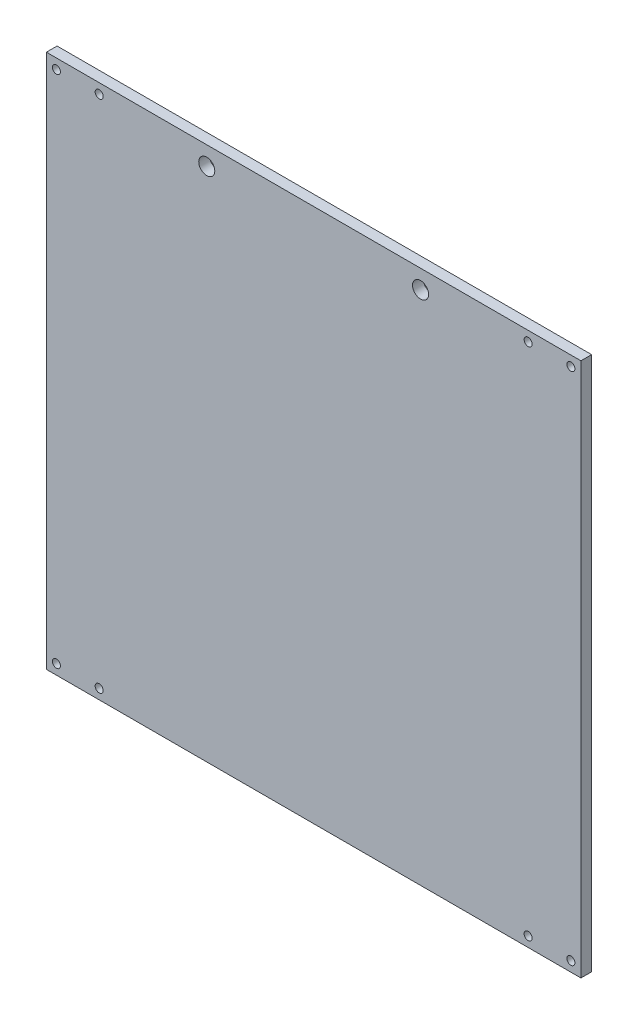
ISO-10303-21;
HEADER;
FILE_DESCRIPTION(('STEP AP214'),'2;1');
FILE_NAME('part.step','',(''),(''),'','','');
FILE_SCHEMA(('AUTOMOTIVE_DESIGN { 1 0 10303 214 1 1 1 1 }'));
ENDSEC;
DATA;
#1=APPLICATION_CONTEXT('core data for automotive mechanical design processes');
#2=APPLICATION_PROTOCOL_DEFINITION('international standard','automotive_design',2000,#1);
#3=PRODUCT_CONTEXT('',#1,'mechanical');
#4=PRODUCT('Part','Part','',(#3));
#5=PRODUCT_RELATED_PRODUCT_CATEGORY('part','',(#4));
#6=PRODUCT_DEFINITION_FORMATION('','',#4);
#7=PRODUCT_DEFINITION_CONTEXT('part definition',#1,'design');
#8=PRODUCT_DEFINITION('design','',#6,#7);
#9=PRODUCT_DEFINITION_SHAPE('','',#8);
#10=(LENGTH_UNIT() NAMED_UNIT(*) SI_UNIT(.MILLI.,.METRE.));
#11=(NAMED_UNIT(*) PLANE_ANGLE_UNIT() SI_UNIT($,.RADIAN.));
#12=(NAMED_UNIT(*) SI_UNIT($,.STERADIAN.) SOLID_ANGLE_UNIT());
#13=UNCERTAINTY_MEASURE_WITH_UNIT(LENGTH_MEASURE(1.E-05),#10,'distance_accuracy_value','');
#14=(GEOMETRIC_REPRESENTATION_CONTEXT(3) GLOBAL_UNCERTAINTY_ASSIGNED_CONTEXT((#13)) GLOBAL_UNIT_ASSIGNED_CONTEXT((#10,
#11,#12)) REPRESENTATION_CONTEXT('',''));
#15=CARTESIAN_POINT('',(0.,0.,0.));
#16=DIRECTION('',(0.,0.,1.));
#17=DIRECTION('',(1.,0.,0.));
#18=AXIS2_PLACEMENT_3D('',#15,#16,#17);
#19=CARTESIAN_POINT('',(0.,0.,4.));
#20=DIRECTION('',(0.,0.,-1.));
#21=DIRECTION('',(-1.,0.,0.));
#22=AXIS2_PLACEMENT_3D('',#19,#20,#21);
#23=PLANE('',#22);
#24=CARTESIAN_POINT('',(40.,93.,4.));
#25=DIRECTION('',(0.,0.,-1.));
#26=DIRECTION('',(-1.,0.,0.));
#27=AXIS2_PLACEMENT_3D('',#24,#25,#26);
#28=CIRCLE('',#27,3.);
#29=CARTESIAN_POINT('',(37.,93.,4.));
#30=VERTEX_POINT('',#29);
#31=EDGE_CURVE('E158',#30,#30,#28,.F.);
#32=ORIENTED_EDGE('',*,*,#31,.F.);
#33=EDGE_LOOP('',(#32));
#34=FACE_BOUND('',#33,.T.);
#35=CARTESIAN_POINT('',(-40.,93.,4.));
#36=DIRECTION('',(0.,0.,-1.));
#37=DIRECTION('',(-1.,0.,0.));
#38=AXIS2_PLACEMENT_3D('',#35,#36,#37);
#39=CIRCLE('',#38,3.);
#40=CARTESIAN_POINT('',(-43.,93.,4.));
#41=VERTEX_POINT('',#40);
#42=EDGE_CURVE('E159',#41,#41,#39,.F.);
#43=ORIENTED_EDGE('',*,*,#42,.F.);
#44=EDGE_LOOP('',(#43));
#45=FACE_BOUND('',#44,.T.);
#46=CARTESIAN_POINT('',(-96.25,-96.25,4.));
#47=DIRECTION('',(0.,0.,1.));
#48=DIRECTION('',(1.,0.,0.));
#49=AXIS2_PLACEMENT_3D('',#46,#47,#48);
#50=CIRCLE('',#49,1.49999999999999);
#51=CARTESIAN_POINT('',(-94.75,-96.25,4.));
#52=VERTEX_POINT('',#51);
#53=EDGE_CURVE('E149',#52,#52,#50,.T.);
#54=ORIENTED_EDGE('',*,*,#53,.F.);
#55=EDGE_LOOP('',(#54));
#56=FACE_BOUND('',#55,.T.);
#57=CARTESIAN_POINT('',(96.25,-96.25,4.));
#58=DIRECTION('',(0.,0.,1.));
#59=DIRECTION('',(1.,0.,0.));
#60=AXIS2_PLACEMENT_3D('',#57,#58,#59);
#61=CIRCLE('',#60,1.49999999999999);
#62=CARTESIAN_POINT('',(97.75,-96.25,4.));
#63=VERTEX_POINT('',#62);
#64=EDGE_CURVE('E137',#63,#63,#61,.T.);
#65=ORIENTED_EDGE('',*,*,#64,.F.);
#66=EDGE_LOOP('',(#65));
#67=FACE_BOUND('',#66,.T.);
#68=CARTESIAN_POINT('',(96.25,96.25,4.));
#69=DIRECTION('',(0.,0.,1.));
#70=DIRECTION('',(1.,0.,0.));
#71=AXIS2_PLACEMENT_3D('',#68,#69,#70);
#72=CIRCLE('',#71,1.49999999999999);
#73=CARTESIAN_POINT('',(97.75,96.25,4.));
#74=VERTEX_POINT('',#73);
#75=EDGE_CURVE('E125',#74,#74,#72,.T.);
#76=ORIENTED_EDGE('',*,*,#75,.F.);
#77=EDGE_LOOP('',(#76));
#78=FACE_BOUND('',#77,.T.);
#79=CARTESIAN_POINT('',(-96.25,96.25,4.));
#80=DIRECTION('',(0.,0.,1.));
#81=DIRECTION('',(1.,0.,0.));
#82=AXIS2_PLACEMENT_3D('',#79,#80,#81);
#83=CIRCLE('',#82,1.49999999999999);
#84=CARTESIAN_POINT('',(-94.75,96.25,4.));
#85=VERTEX_POINT('',#84);
#86=EDGE_CURVE('E113',#85,#85,#83,.T.);
#87=ORIENTED_EDGE('',*,*,#86,.F.);
#88=EDGE_LOOP('',(#87));
#89=FACE_BOUND('',#88,.T.);
#90=DIRECTION('',(0.,1.,0.));
#91=VECTOR('',#90,1.);
#92=CARTESIAN_POINT('',(100.,-100.,4.));
#93=LINE('',#92,#91);
#94=CARTESIAN_POINT('',(100.,-100.,4.));
#95=VERTEX_POINT('',#94);
#96=CARTESIAN_POINT('',(100.,100.,4.));
#97=VERTEX_POINT('',#96);
#98=EDGE_CURVE('E85',#95,#97,#93,.T.);
#99=ORIENTED_EDGE('',*,*,#98,.T.);
#100=DIRECTION('',(-1.,0.,0.));
#101=VECTOR('',#100,1.);
#102=CARTESIAN_POINT('',(-100.,100.,4.));
#103=LINE('',#102,#101);
#104=CARTESIAN_POINT('',(-100.,100.,4.));
#105=VERTEX_POINT('',#104);
#106=EDGE_CURVE('E80',#97,#105,#103,.T.);
#107=ORIENTED_EDGE('',*,*,#106,.T.);
#108=DIRECTION('',(0.,-1.,0.));
#109=VECTOR('',#108,1.);
#110=CARTESIAN_POINT('',(-100.,-100.,4.));
#111=LINE('',#110,#109);
#112=CARTESIAN_POINT('',(-100.,-100.,4.));
#113=VERTEX_POINT('',#112);
#114=EDGE_CURVE('E83',#105,#113,#111,.T.);
#115=ORIENTED_EDGE('',*,*,#114,.T.);
#116=DIRECTION('',(1.,0.,0.));
#117=VECTOR('',#116,1.);
#118=CARTESIAN_POINT('',(-100.,-100.,4.));
#119=LINE('',#118,#117);
#120=EDGE_CURVE('E50',#113,#95,#119,.T.);
#121=ORIENTED_EDGE('',*,*,#120,.T.);
#122=EDGE_LOOP('',(#99,#107,#115,#121));
#123=FACE_BOUND('',#122,.T.);
#124=CARTESIAN_POINT('',(-80.25,96.25,4.));
#125=DIRECTION('',(0.,0.,1.));
#126=DIRECTION('',(1.,0.,0.));
#127=AXIS2_PLACEMENT_3D('',#124,#125,#126);
#128=CIRCLE('',#127,1.49999999999999);
#129=CARTESIAN_POINT('',(-78.75,96.25,4.));
#130=VERTEX_POINT('',#129);
#131=EDGE_CURVE('E119',#130,#130,#128,.T.);
#132=ORIENTED_EDGE('',*,*,#131,.F.);
#133=EDGE_LOOP('',(#132));
#134=FACE_BOUND('',#133,.T.);
#135=CARTESIAN_POINT('',(80.25,96.25,4.));
#136=DIRECTION('',(0.,0.,1.));
#137=DIRECTION('',(1.,0.,0.));
#138=AXIS2_PLACEMENT_3D('',#135,#136,#137);
#139=CIRCLE('',#138,1.49999999999999);
#140=CARTESIAN_POINT('',(81.75,96.25,4.));
#141=VERTEX_POINT('',#140);
#142=EDGE_CURVE('E131',#141,#141,#139,.T.);
#143=ORIENTED_EDGE('',*,*,#142,.F.);
#144=EDGE_LOOP('',(#143));
#145=FACE_BOUND('',#144,.T.);
#146=CARTESIAN_POINT('',(80.25,-96.25,4.));
#147=DIRECTION('',(0.,0.,1.));
#148=DIRECTION('',(1.,0.,0.));
#149=AXIS2_PLACEMENT_3D('',#146,#147,#148);
#150=CIRCLE('',#149,1.49999999999999);
#151=CARTESIAN_POINT('',(81.75,-96.25,4.));
#152=VERTEX_POINT('',#151);
#153=EDGE_CURVE('E143',#152,#152,#150,.T.);
#154=ORIENTED_EDGE('',*,*,#153,.F.);
#155=EDGE_LOOP('',(#154));
#156=FACE_BOUND('',#155,.T.);
#157=CARTESIAN_POINT('',(-80.25,-96.25,4.));
#158=DIRECTION('',(0.,0.,1.));
#159=DIRECTION('',(1.,0.,0.));
#160=AXIS2_PLACEMENT_3D('',#157,#158,#159);
#161=CIRCLE('',#160,1.49999999999999);
#162=CARTESIAN_POINT('',(-78.75,-96.25,4.));
#163=VERTEX_POINT('',#162);
#164=EDGE_CURVE('E155',#163,#163,#161,.T.);
#165=ORIENTED_EDGE('',*,*,#164,.F.);
#166=EDGE_LOOP('',(#165));
#167=FACE_BOUND('',#166,.T.);
#168=ADVANCED_FACE('F33',(#34,#45,#56,#67,#78,#89,#123,#134,#145,#156,#167),#23,.F.);
#169=CARTESIAN_POINT('',(100.,-100.,4.));
#170=DIRECTION('',(-1.,0.,0.));
#171=DIRECTION('',(0.,0.,1.));
#172=AXIS2_PLACEMENT_3D('',#169,#170,#171);
#173=PLANE('',#172);
#174=DIRECTION('',(0.,1.,0.));
#175=VECTOR('',#174,1.);
#176=CARTESIAN_POINT('',(100.,-100.,0.));
#177=LINE('',#176,#175);
#178=CARTESIAN_POINT('',(100.,-100.,0.));
#179=VERTEX_POINT('',#178);
#180=CARTESIAN_POINT('',(100.,100.,0.));
#181=VERTEX_POINT('',#180);
#182=EDGE_CURVE('E97',#179,#181,#177,.T.);
#183=ORIENTED_EDGE('',*,*,#182,.T.);
#184=DIRECTION('',(0.,0.,-1.));
#185=VECTOR('',#184,1.);
#186=CARTESIAN_POINT('',(100.,100.,4.));
#187=LINE('',#186,#185);
#188=EDGE_CURVE('E11',#97,#181,#187,.T.);
#189=ORIENTED_EDGE('',*,*,#188,.F.);
#190=ORIENTED_EDGE('',*,*,#98,.F.);
#191=DIRECTION('',(0.,0.,-1.));
#192=VECTOR('',#191,1.);
#193=CARTESIAN_POINT('',(100.,-100.,4.));
#194=LINE('',#193,#192);
#195=EDGE_CURVE('E93',#95,#179,#194,.T.);
#196=ORIENTED_EDGE('',*,*,#195,.T.);
#197=EDGE_LOOP('',(#183,#189,#190,#196));
#198=FACE_BOUND('',#197,.T.);
#199=ADVANCED_FACE('F35',(#198),#173,.F.);
#200=CARTESIAN_POINT('',(-100.,100.,4.));
#201=DIRECTION('',(0.,-1.,0.));
#202=DIRECTION('',(0.,0.,-1.));
#203=AXIS2_PLACEMENT_3D('',#200,#201,#202);
#204=PLANE('',#203);
#205=DIRECTION('',(-1.,0.,0.));
#206=VECTOR('',#205,1.);
#207=CARTESIAN_POINT('',(-100.,100.,0.));
#208=LINE('',#207,#206);
#209=CARTESIAN_POINT('',(-100.,100.,0.));
#210=VERTEX_POINT('',#209);
#211=EDGE_CURVE('E89',#181,#210,#208,.T.);
#212=ORIENTED_EDGE('',*,*,#211,.T.);
#213=DIRECTION('',(0.,0.,-1.));
#214=VECTOR('',#213,1.);
#215=CARTESIAN_POINT('',(-100.,100.,4.));
#216=LINE('',#215,#214);
#217=EDGE_CURVE('E42',#105,#210,#216,.T.);
#218=ORIENTED_EDGE('',*,*,#217,.F.);
#219=ORIENTED_EDGE('',*,*,#106,.F.);
#220=ORIENTED_EDGE('',*,*,#188,.T.);
#221=EDGE_LOOP('',(#212,#218,#219,#220));
#222=FACE_BOUND('',#221,.T.);
#223=ADVANCED_FACE('F88',(#222),#204,.F.);
#224=CARTESIAN_POINT('',(-100.,-100.,4.));
#225=DIRECTION('',(1.,0.,0.));
#226=DIRECTION('',(0.,0.,-1.));
#227=AXIS2_PLACEMENT_3D('',#224,#225,#226);
#228=PLANE('',#227);
#229=DIRECTION('',(0.,-1.,0.));
#230=VECTOR('',#229,1.);
#231=CARTESIAN_POINT('',(-100.,-100.,0.));
#232=LINE('',#231,#230);
#233=CARTESIAN_POINT('',(-100.,-100.,0.));
#234=VERTEX_POINT('',#233);
#235=EDGE_CURVE('E67',#210,#234,#232,.T.);
#236=ORIENTED_EDGE('',*,*,#235,.T.);
#237=DIRECTION('',(0.,0.,-1.));
#238=VECTOR('',#237,1.);
#239=CARTESIAN_POINT('',(-100.,-100.,4.));
#240=LINE('',#239,#238);
#241=EDGE_CURVE('E90',#113,#234,#240,.T.);
#242=ORIENTED_EDGE('',*,*,#241,.F.);
#243=ORIENTED_EDGE('',*,*,#114,.F.);
#244=ORIENTED_EDGE('',*,*,#217,.T.);
#245=EDGE_LOOP('',(#236,#242,#243,#244));
#246=FACE_BOUND('',#245,.T.);
#247=ADVANCED_FACE('F91',(#246),#228,.F.);
#248=CARTESIAN_POINT('',(-100.,-100.,4.));
#249=DIRECTION('',(0.,1.,0.));
#250=DIRECTION('',(0.,0.,1.));
#251=AXIS2_PLACEMENT_3D('',#248,#249,#250);
#252=PLANE('',#251);
#253=DIRECTION('',(1.,0.,0.));
#254=VECTOR('',#253,1.);
#255=CARTESIAN_POINT('',(-100.,-100.,0.));
#256=LINE('',#255,#254);
#257=EDGE_CURVE('E73',#234,#179,#256,.T.);
#258=ORIENTED_EDGE('',*,*,#257,.T.);
#259=ORIENTED_EDGE('',*,*,#195,.F.);
#260=ORIENTED_EDGE('',*,*,#120,.F.);
#261=ORIENTED_EDGE('',*,*,#241,.T.);
#262=EDGE_LOOP('',(#258,#259,#260,#261));
#263=FACE_BOUND('',#262,.T.);
#264=ADVANCED_FACE('F105',(#263),#252,.F.);
#265=CARTESIAN_POINT('',(0.,0.,0.));
#266=DIRECTION('',(0.,0.,-1.));
#267=DIRECTION('',(-1.,0.,0.));
#268=AXIS2_PLACEMENT_3D('',#265,#266,#267);
#269=PLANE('',#268);
#270=CARTESIAN_POINT('',(40.,93.,0.));
#271=DIRECTION('',(0.,0.,-1.));
#272=DIRECTION('',(-1.,0.,0.));
#273=AXIS2_PLACEMENT_3D('',#270,#271,#272);
#274=CIRCLE('',#273,3.);
#275=CARTESIAN_POINT('',(37.,93.,0.));
#276=VERTEX_POINT('',#275);
#277=EDGE_CURVE('E162',#276,#276,#274,.T.);
#278=ORIENTED_EDGE('',*,*,#277,.F.);
#279=EDGE_LOOP('',(#278));
#280=FACE_BOUND('',#279,.T.);
#281=CARTESIAN_POINT('',(-40.,93.,0.));
#282=DIRECTION('',(0.,0.,-1.));
#283=DIRECTION('',(-1.,0.,0.));
#284=AXIS2_PLACEMENT_3D('',#281,#282,#283);
#285=CIRCLE('',#284,3.);
#286=CARTESIAN_POINT('',(-43.,93.,0.));
#287=VERTEX_POINT('',#286);
#288=EDGE_CURVE('E163',#287,#287,#285,.T.);
#289=ORIENTED_EDGE('',*,*,#288,.F.);
#290=EDGE_LOOP('',(#289));
#291=FACE_BOUND('',#290,.T.);
#292=CARTESIAN_POINT('',(-80.25,-96.25,0.));
#293=DIRECTION('',(0.,0.,-1.));
#294=DIRECTION('',(-1.,0.,0.));
#295=AXIS2_PLACEMENT_3D('',#292,#293,#294);
#296=CIRCLE('',#295,1.49999999999999);
#297=CARTESIAN_POINT('',(-81.75,-96.25,0.));
#298=VERTEX_POINT('',#297);
#299=EDGE_CURVE('E152',#298,#298,#296,.T.);
#300=ORIENTED_EDGE('',*,*,#299,.F.);
#301=EDGE_LOOP('',(#300));
#302=FACE_BOUND('',#301,.T.);
#303=CARTESIAN_POINT('',(-96.25,-96.25,0.));
#304=DIRECTION('',(0.,0.,-1.));
#305=DIRECTION('',(-1.,0.,0.));
#306=AXIS2_PLACEMENT_3D('',#303,#304,#305);
#307=CIRCLE('',#306,1.49999999999999);
#308=CARTESIAN_POINT('',(-97.75,-96.25,0.));
#309=VERTEX_POINT('',#308);
#310=EDGE_CURVE('E146',#309,#309,#307,.T.);
#311=ORIENTED_EDGE('',*,*,#310,.F.);
#312=EDGE_LOOP('',(#311));
#313=FACE_BOUND('',#312,.T.);
#314=CARTESIAN_POINT('',(80.25,-96.25,0.));
#315=DIRECTION('',(0.,0.,-1.));
#316=DIRECTION('',(-1.,0.,0.));
#317=AXIS2_PLACEMENT_3D('',#314,#315,#316);
#318=CIRCLE('',#317,1.49999999999999);
#319=CARTESIAN_POINT('',(78.75,-96.25,0.));
#320=VERTEX_POINT('',#319);
#321=EDGE_CURVE('E140',#320,#320,#318,.T.);
#322=ORIENTED_EDGE('',*,*,#321,.F.);
#323=EDGE_LOOP('',(#322));
#324=FACE_BOUND('',#323,.T.);
#325=CARTESIAN_POINT('',(96.25,-96.25,0.));
#326=DIRECTION('',(0.,0.,-1.));
#327=DIRECTION('',(-1.,0.,0.));
#328=AXIS2_PLACEMENT_3D('',#325,#326,#327);
#329=CIRCLE('',#328,1.49999999999999);
#330=CARTESIAN_POINT('',(94.75,-96.25,0.));
#331=VERTEX_POINT('',#330);
#332=EDGE_CURVE('E134',#331,#331,#329,.T.);
#333=ORIENTED_EDGE('',*,*,#332,.F.);
#334=EDGE_LOOP('',(#333));
#335=FACE_BOUND('',#334,.T.);
#336=CARTESIAN_POINT('',(80.25,96.25,0.));
#337=DIRECTION('',(0.,0.,-1.));
#338=DIRECTION('',(-1.,0.,0.));
#339=AXIS2_PLACEMENT_3D('',#336,#337,#338);
#340=CIRCLE('',#339,1.49999999999999);
#341=CARTESIAN_POINT('',(78.75,96.25,0.));
#342=VERTEX_POINT('',#341);
#343=EDGE_CURVE('E128',#342,#342,#340,.T.);
#344=ORIENTED_EDGE('',*,*,#343,.F.);
#345=EDGE_LOOP('',(#344));
#346=FACE_BOUND('',#345,.T.);
#347=CARTESIAN_POINT('',(96.25,96.25,0.));
#348=DIRECTION('',(0.,0.,-1.));
#349=DIRECTION('',(-1.,0.,0.));
#350=AXIS2_PLACEMENT_3D('',#347,#348,#349);
#351=CIRCLE('',#350,1.49999999999999);
#352=CARTESIAN_POINT('',(94.75,96.25,0.));
#353=VERTEX_POINT('',#352);
#354=EDGE_CURVE('E122',#353,#353,#351,.T.);
#355=ORIENTED_EDGE('',*,*,#354,.F.);
#356=EDGE_LOOP('',(#355));
#357=FACE_BOUND('',#356,.T.);
#358=CARTESIAN_POINT('',(-80.25,96.25,0.));
#359=DIRECTION('',(0.,0.,-1.));
#360=DIRECTION('',(-1.,0.,0.));
#361=AXIS2_PLACEMENT_3D('',#358,#359,#360);
#362=CIRCLE('',#361,1.49999999999999);
#363=CARTESIAN_POINT('',(-81.75,96.25,0.));
#364=VERTEX_POINT('',#363);
#365=EDGE_CURVE('E116',#364,#364,#362,.T.);
#366=ORIENTED_EDGE('',*,*,#365,.F.);
#367=EDGE_LOOP('',(#366));
#368=FACE_BOUND('',#367,.T.);
#369=CARTESIAN_POINT('',(-96.25,96.25,0.));
#370=DIRECTION('',(0.,0.,-1.));
#371=DIRECTION('',(-1.,0.,0.));
#372=AXIS2_PLACEMENT_3D('',#369,#370,#371);
#373=CIRCLE('',#372,1.49999999999999);
#374=CARTESIAN_POINT('',(-97.75,96.25,0.));
#375=VERTEX_POINT('',#374);
#376=EDGE_CURVE('E100',#375,#375,#373,.T.);
#377=ORIENTED_EDGE('',*,*,#376,.F.);
#378=EDGE_LOOP('',(#377));
#379=FACE_BOUND('',#378,.T.);
#380=ORIENTED_EDGE('',*,*,#182,.F.);
#381=ORIENTED_EDGE('',*,*,#257,.F.);
#382=ORIENTED_EDGE('',*,*,#235,.F.);
#383=ORIENTED_EDGE('',*,*,#211,.F.);
#384=EDGE_LOOP('',(#380,#381,#382,#383));
#385=FACE_BOUND('',#384,.T.);
#386=ADVANCED_FACE('F108',(#280,#291,#302,#313,#324,#335,#346,#357,#368,#379,#385),#269,.T.);
#387=CARTESIAN_POINT('',(-96.25,96.25,4.));
#388=DIRECTION('',(0.,0.,1.));
#389=DIRECTION('',(1.,0.,0.));
#390=AXIS2_PLACEMENT_3D('',#387,#388,#389);
#391=CYLINDRICAL_SURFACE('',#390,1.49999999999999);
#392=ORIENTED_EDGE('',*,*,#86,.T.);
#393=EDGE_LOOP('',(#392));
#394=FACE_BOUND('',#393,.T.);
#395=ORIENTED_EDGE('',*,*,#376,.T.);
#396=EDGE_LOOP('',(#395));
#397=FACE_BOUND('',#396,.T.);
#398=ADVANCED_FACE('F176',(#394,#397),#391,.F.);
#399=CARTESIAN_POINT('',(-80.25,96.25,4.));
#400=DIRECTION('',(0.,0.,1.));
#401=DIRECTION('',(1.,0.,0.));
#402=AXIS2_PLACEMENT_3D('',#399,#400,#401);
#403=CYLINDRICAL_SURFACE('',#402,1.49999999999999);
#404=ORIENTED_EDGE('',*,*,#131,.T.);
#405=EDGE_LOOP('',(#404));
#406=FACE_BOUND('',#405,.T.);
#407=ORIENTED_EDGE('',*,*,#365,.T.);
#408=EDGE_LOOP('',(#407));
#409=FACE_BOUND('',#408,.T.);
#410=ADVANCED_FACE('F197',(#406,#409),#403,.F.);
#411=CARTESIAN_POINT('',(96.25,96.25,4.));
#412=DIRECTION('',(0.,0.,1.));
#413=DIRECTION('',(1.,0.,0.));
#414=AXIS2_PLACEMENT_3D('',#411,#412,#413);
#415=CYLINDRICAL_SURFACE('',#414,1.49999999999999);
#416=ORIENTED_EDGE('',*,*,#75,.T.);
#417=EDGE_LOOP('',(#416));
#418=FACE_BOUND('',#417,.T.);
#419=ORIENTED_EDGE('',*,*,#354,.T.);
#420=EDGE_LOOP('',(#419));
#421=FACE_BOUND('',#420,.T.);
#422=ADVANCED_FACE('F204',(#418,#421),#415,.F.);
#423=CARTESIAN_POINT('',(80.25,96.25,4.));
#424=DIRECTION('',(0.,0.,1.));
#425=DIRECTION('',(1.,0.,0.));
#426=AXIS2_PLACEMENT_3D('',#423,#424,#425);
#427=CYLINDRICAL_SURFACE('',#426,1.49999999999999);
#428=ORIENTED_EDGE('',*,*,#142,.T.);
#429=EDGE_LOOP('',(#428));
#430=FACE_BOUND('',#429,.T.);
#431=ORIENTED_EDGE('',*,*,#343,.T.);
#432=EDGE_LOOP('',(#431));
#433=FACE_BOUND('',#432,.T.);
#434=ADVANCED_FACE('F248',(#430,#433),#427,.F.);
#435=CARTESIAN_POINT('',(96.25,-96.25,4.));
#436=DIRECTION('',(0.,0.,1.));
#437=DIRECTION('',(1.,0.,0.));
#438=AXIS2_PLACEMENT_3D('',#435,#436,#437);
#439=CYLINDRICAL_SURFACE('',#438,1.49999999999999);
#440=ORIENTED_EDGE('',*,*,#64,.T.);
#441=EDGE_LOOP('',(#440));
#442=FACE_BOUND('',#441,.T.);
#443=ORIENTED_EDGE('',*,*,#332,.T.);
#444=EDGE_LOOP('',(#443));
#445=FACE_BOUND('',#444,.T.);
#446=ADVANCED_FACE('F253',(#442,#445),#439,.F.);
#447=CARTESIAN_POINT('',(80.25,-96.25,4.));
#448=DIRECTION('',(0.,0.,1.));
#449=DIRECTION('',(1.,0.,0.));
#450=AXIS2_PLACEMENT_3D('',#447,#448,#449);
#451=CYLINDRICAL_SURFACE('',#450,1.49999999999999);
#452=ORIENTED_EDGE('',*,*,#153,.T.);
#453=EDGE_LOOP('',(#452));
#454=FACE_BOUND('',#453,.T.);
#455=ORIENTED_EDGE('',*,*,#321,.T.);
#456=EDGE_LOOP('',(#455));
#457=FACE_BOUND('',#456,.T.);
#458=ADVANCED_FACE('F259',(#454,#457),#451,.F.);
#459=CARTESIAN_POINT('',(-96.25,-96.25,4.));
#460=DIRECTION('',(0.,0.,1.));
#461=DIRECTION('',(1.,0.,0.));
#462=AXIS2_PLACEMENT_3D('',#459,#460,#461);
#463=CYLINDRICAL_SURFACE('',#462,1.49999999999999);
#464=ORIENTED_EDGE('',*,*,#53,.T.);
#465=EDGE_LOOP('',(#464));
#466=FACE_BOUND('',#465,.T.);
#467=ORIENTED_EDGE('',*,*,#310,.T.);
#468=EDGE_LOOP('',(#467));
#469=FACE_BOUND('',#468,.T.);
#470=ADVANCED_FACE('F268',(#466,#469),#463,.F.);
#471=CARTESIAN_POINT('',(-80.25,-96.25,4.));
#472=DIRECTION('',(0.,0.,1.));
#473=DIRECTION('',(1.,0.,0.));
#474=AXIS2_PLACEMENT_3D('',#471,#472,#473);
#475=CYLINDRICAL_SURFACE('',#474,1.49999999999999);
#476=ORIENTED_EDGE('',*,*,#164,.T.);
#477=EDGE_LOOP('',(#476));
#478=FACE_BOUND('',#477,.T.);
#479=ORIENTED_EDGE('',*,*,#299,.T.);
#480=EDGE_LOOP('',(#479));
#481=FACE_BOUND('',#480,.T.);
#482=ADVANCED_FACE('F277',(#478,#481),#475,.F.);
#483=CARTESIAN_POINT('',(-40.,93.,4.001));
#484=DIRECTION('',(0.,0.,-1.));
#485=DIRECTION('',(-1.,0.,0.));
#486=AXIS2_PLACEMENT_3D('',#483,#484,#485);
#487=CYLINDRICAL_SURFACE('',#486,3.);
#488=ORIENTED_EDGE('',*,*,#288,.T.);
#489=EDGE_LOOP('',(#488));
#490=FACE_BOUND('',#489,.T.);
#491=ORIENTED_EDGE('',*,*,#42,.T.);
#492=EDGE_LOOP('',(#491));
#493=FACE_BOUND('',#492,.T.);
#494=ADVANCED_FACE('F285',(#490,#493),#487,.F.);
#495=CARTESIAN_POINT('',(40.,93.,4.001));
#496=DIRECTION('',(0.,0.,-1.));
#497=DIRECTION('',(-1.,0.,0.));
#498=AXIS2_PLACEMENT_3D('',#495,#496,#497);
#499=CYLINDRICAL_SURFACE('',#498,3.);
#500=ORIENTED_EDGE('',*,*,#277,.T.);
#501=EDGE_LOOP('',(#500));
#502=FACE_BOUND('',#501,.T.);
#503=ORIENTED_EDGE('',*,*,#31,.T.);
#504=EDGE_LOOP('',(#503));
#505=FACE_BOUND('',#504,.T.);
#506=ADVANCED_FACE('F171',(#502,#505),#499,.F.);
#507=CLOSED_SHELL('',(#168,#199,#223,#247,#264,#386,#398,#410,#422,#434,#446,#458,#470,#482,
#494,#506));
#508=MANIFOLD_SOLID_BREP('B2',#507);
#509=ADVANCED_BREP_SHAPE_REPRESENTATION('',(#18,#508),#14);
#510=SHAPE_DEFINITION_REPRESENTATION(#9,#509);
ENDSEC;
END-ISO-10303-21;
